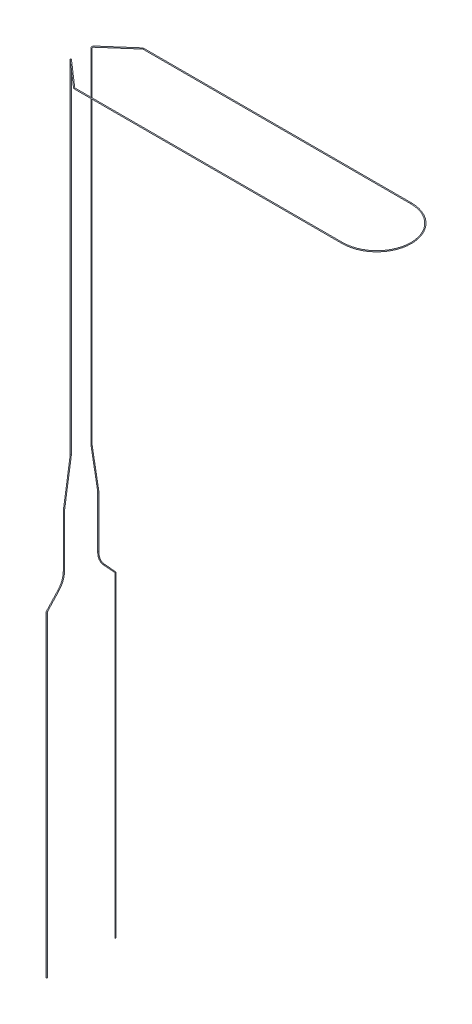
ISO-10303-21;
HEADER;
FILE_DESCRIPTION(('STEP AP214'),'2;1');
FILE_NAME('part.step','',(''),(''),'','','');
FILE_SCHEMA(('AUTOMOTIVE_DESIGN { 1 0 10303 214 1 1 1 1 }'));
ENDSEC;
DATA;
#1=APPLICATION_CONTEXT('core data for automotive mechanical design processes');
#2=APPLICATION_PROTOCOL_DEFINITION('international standard','automotive_design',2000,#1);
#3=PRODUCT_CONTEXT('',#1,'mechanical');
#4=PRODUCT('Part','Part','',(#3));
#5=PRODUCT_RELATED_PRODUCT_CATEGORY('part','',(#4));
#6=PRODUCT_DEFINITION_FORMATION('','',#4);
#7=PRODUCT_DEFINITION_CONTEXT('part definition',#1,'design');
#8=PRODUCT_DEFINITION('design','',#6,#7);
#9=PRODUCT_DEFINITION_SHAPE('','',#8);
#10=(LENGTH_UNIT() NAMED_UNIT(*) SI_UNIT(.MILLI.,.METRE.));
#11=(NAMED_UNIT(*) PLANE_ANGLE_UNIT() SI_UNIT($,.RADIAN.));
#12=(NAMED_UNIT(*) SI_UNIT($,.STERADIAN.) SOLID_ANGLE_UNIT());
#13=UNCERTAINTY_MEASURE_WITH_UNIT(LENGTH_MEASURE(1.E-05),#10,'distance_accuracy_value','');
#14=(GEOMETRIC_REPRESENTATION_CONTEXT(3) GLOBAL_UNCERTAINTY_ASSIGNED_CONTEXT((#13)) GLOBAL_UNIT_ASSIGNED_CONTEXT((#10,
#11,#12)) REPRESENTATION_CONTEXT('',''));
#15=CARTESIAN_POINT('',(0.,0.,0.));
#16=DIRECTION('',(0.,0.,1.));
#17=DIRECTION('',(1.,0.,0.));
#18=AXIS2_PLACEMENT_3D('',#15,#16,#17);
#19=CARTESIAN_POINT('',(0.,-200.,20.));
#20=DIRECTION('',(0.,-1.,0.));
#21=DIRECTION('',(-1.,0.,0.));
#22=AXIS2_PLACEMENT_3D('',#19,#20,#21);
#23=PLANE('',#22);
#24=CARTESIAN_POINT('',(0.,-200.,20.));
#25=DIRECTION('',(0.,-1.,0.));
#26=DIRECTION('',(-1.,0.,0.));
#27=AXIS2_PLACEMENT_3D('',#24,#25,#26);
#28=CIRCLE('',#27,0.25);
#29=CARTESIAN_POINT('',(-0.249999999999906,-200.,20.));
#30=VERTEX_POINT('',#29);
#31=EDGE_CURVE('E142',#30,#30,#28,.T.);
#32=ORIENTED_EDGE('',*,*,#31,.T.);
#33=EDGE_LOOP('',(#32));
#34=FACE_BOUND('',#33,.T.);
#35=ADVANCED_FACE('F48',(#34),#23,.T.);
#36=CARTESIAN_POINT('',(0.,-200.,-20.));
#37=DIRECTION('',(0.,1.,0.));
#38=DIRECTION('',(-1.,0.,0.));
#39=AXIS2_PLACEMENT_3D('',#36,#37,#38);
#40=PLANE('',#39);
#41=CARTESIAN_POINT('',(0.,-200.,-20.));
#42=DIRECTION('',(0.,1.,0.));
#43=DIRECTION('',(-1.,0.,0.));
#44=AXIS2_PLACEMENT_3D('',#41,#42,#43);
#45=CIRCLE('',#44,0.25);
#46=CARTESIAN_POINT('',(-0.249999999999906,-200.,-20.));
#47=VERTEX_POINT('',#46);
#48=EDGE_CURVE('E11',#47,#47,#45,.T.);
#49=ORIENTED_EDGE('',*,*,#48,.F.);
#50=EDGE_LOOP('',(#49));
#51=FACE_BOUND('',#50,.T.);
#52=ADVANCED_FACE('F150',(#51),#40,.F.);
#53=CARTESIAN_POINT('',(0.,-200.,20.));
#54=DIRECTION('',(0.,1.,0.));
#55=DIRECTION('',(-1.,0.,0.));
#56=AXIS2_PLACEMENT_3D('',#53,#54,#55);
#57=CYLINDRICAL_SURFACE('',#56,0.25);
#58=CARTESIAN_POINT('',(0.,-16.2259715403941,20.));
#59=DIRECTION('',(0.,-1.,0.));
#60=DIRECTION('',(-1.,0.,0.));
#61=AXIS2_PLACEMENT_3D('',#58,#59,#60);
#62=CIRCLE('',#61,0.25);
#63=CARTESIAN_POINT('',(0.,-16.2259715403941,20.25));
#64=VERTEX_POINT('',#63);
#65=EDGE_CURVE('E139',#64,#64,#62,.T.);
#66=ORIENTED_EDGE('',*,*,#65,.T.);
#67=EDGE_LOOP('',(#66));
#68=FACE_BOUND('',#67,.T.);
#69=ORIENTED_EDGE('',*,*,#31,.F.);
#70=EDGE_LOOP('',(#69));
#71=FACE_BOUND('',#70,.T.);
#72=ADVANCED_FACE('F147',(#68,#71),#57,.T.);
#73=CARTESIAN_POINT('',(0.,-16.2259715403941,19.));
#74=DIRECTION('',(-1.,0.,0.));
#75=DIRECTION('',(0.,0.,1.));
#76=AXIS2_PLACEMENT_3D('',#73,#74,#75);
#77=TOROIDAL_SURFACE('',#76,1.,0.25);
#78=CARTESIAN_POINT('',(0.,-15.5476836140616,19.7347962227662));
#79=DIRECTION('',(0.,-0.734796222766241,0.678287926332516));
#80=DIRECTION('',(-1.,0.,0.));
#81=AXIS2_PLACEMENT_3D('',#78,#79,#80);
#82=CIRCLE('',#81,0.25);
#83=CARTESIAN_POINT('',(0.,-15.3781116324784,19.9184952784578));
#84=VERTEX_POINT('',#83);
#85=EDGE_CURVE('E136',#84,#84,#82,.T.);
#86=CARTESIAN_POINT('',(0.,-16.2259715403941,19.));
#87=DIRECTION('',(-1.,0.,0.));
#88=DIRECTION('',(0.,0.,1.));
#89=AXIS2_PLACEMENT_3D('',#86,#87,#88);
#90=CIRCLE('',#89,1.25);
#91=EDGE_CURVE('',#64,#84,#90,.T.);
#92=ORIENTED_EDGE('',*,*,#65,.F.);
#93=ORIENTED_EDGE('',*,*,#85,.T.);
#94=ORIENTED_EDGE('',*,*,#91,.T.);
#95=ORIENTED_EDGE('',*,*,#91,.F.);
#96=EDGE_LOOP('',(#92,#94,#93,#95));
#97=FACE_BOUND('',#96,.T.);
#98=ADVANCED_FACE('F149',(#97),#77,.T.);
#99=CARTESIAN_POINT('',(0.,-15.5476836140616,19.7347962227662));
#100=DIRECTION('',(0.,0.734796222766239,-0.678287926332518));
#101=DIRECTION('',(0.,0.678287926332518,0.734796222766239));
#102=AXIS2_PLACEMENT_3D('',#99,#100,#101);
#103=CYLINDRICAL_SURFACE('',#102,0.25);
#104=CARTESIAN_POINT('',(0.,-8.44945511599021,13.1824453268051));
#105=DIRECTION('',(0.,-0.734796222766239,0.678287926332518));
#106=DIRECTION('',(-1.,0.,0.));
#107=AXIS2_PLACEMENT_3D('',#104,#105,#106);
#108=CIRCLE('',#107,0.25);
#109=CARTESIAN_POINT('',(0.,-8.61902709757335,12.9987462711136));
#110=VERTEX_POINT('',#109);
#111=EDGE_CURVE('E133',#110,#110,#108,.T.);
#112=ORIENTED_EDGE('',*,*,#111,.T.);
#113=EDGE_LOOP('',(#112));
#114=FACE_BOUND('',#113,.T.);
#115=ORIENTED_EDGE('',*,*,#85,.F.);
#116=EDGE_LOOP('',(#115));
#117=FACE_BOUND('',#116,.T.);
#118=ADVANCED_FACE('F157',(#114,#117),#103,.T.);
#119=CARTESIAN_POINT('',(0.,-0.309999999999999,22.));
#120=DIRECTION('',(1.,0.,0.));
#121=DIRECTION('',(0.,0.,-1.));
#122=AXIS2_PLACEMENT_3D('',#119,#120,#121);
#123=TOROIDAL_SURFACE('',#122,12.,0.25);
#124=CARTESIAN_POINT('',(0.,-0.310000000000005,10.));
#125=DIRECTION('',(0.,-1.,0.));
#126=DIRECTION('',(-1.,0.,0.));
#127=AXIS2_PLACEMENT_3D('',#124,#125,#126);
#128=CIRCLE('',#127,0.25);
#129=CARTESIAN_POINT('',(0.,-0.310000000000005,9.75));
#130=VERTEX_POINT('',#129);
#131=EDGE_CURVE('E130',#130,#130,#128,.T.);
#132=CARTESIAN_POINT('',(0.,-0.309999999999999,22.));
#133=DIRECTION('',(1.,0.,0.));
#134=DIRECTION('',(0.,0.,-1.));
#135=AXIS2_PLACEMENT_3D('',#132,#133,#134);
#136=CIRCLE('',#135,12.25);
#137=EDGE_CURVE('',#110,#130,#136,.T.);
#138=ORIENTED_EDGE('',*,*,#111,.F.);
#139=ORIENTED_EDGE('',*,*,#131,.T.);
#140=ORIENTED_EDGE('',*,*,#137,.T.);
#141=ORIENTED_EDGE('',*,*,#137,.F.);
#142=EDGE_LOOP('',(#138,#140,#139,#141));
#143=FACE_BOUND('',#142,.T.);
#144=ADVANCED_FACE('F262',(#143),#123,.T.);
#145=CARTESIAN_POINT('',(0.,-0.310000000000005,10.));
#146=DIRECTION('',(0.,1.,0.));
#147=DIRECTION('',(-1.,0.,0.));
#148=AXIS2_PLACEMENT_3D('',#145,#146,#147);
#149=CYLINDRICAL_SURFACE('',#148,0.25);
#150=CARTESIAN_POINT('',(0.,0.,10.));
#151=DIRECTION('',(0.,-1.,0.));
#152=DIRECTION('',(-1.,0.,0.));
#153=AXIS2_PLACEMENT_3D('',#150,#151,#152);
#154=CIRCLE('',#153,0.25);
#155=CARTESIAN_POINT('',(-0.249999999999996,0.,10.));
#156=VERTEX_POINT('',#155);
#157=EDGE_CURVE('E127',#156,#156,#154,.T.);
#158=ORIENTED_EDGE('',*,*,#157,.T.);
#159=EDGE_LOOP('',(#158));
#160=FACE_BOUND('',#159,.T.);
#161=ORIENTED_EDGE('',*,*,#131,.F.);
#162=EDGE_LOOP('',(#161));
#163=FACE_BOUND('',#162,.T.);
#164=ADVANCED_FACE('F258',(#160,#163),#149,.T.);
#165=CARTESIAN_POINT('',(0.,0.,10.));
#166=DIRECTION('',(0.,1.,0.));
#167=DIRECTION('',(-1.,0.,0.));
#168=AXIS2_PLACEMENT_3D('',#165,#166,#167);
#169=CYLINDRICAL_SURFACE('',#168,0.25);
#170=CARTESIAN_POINT('',(0.,29.2352678101705,10.));
#171=DIRECTION('',(0.,-1.,0.));
#172=DIRECTION('',(-1.,0.,0.));
#173=AXIS2_PLACEMENT_3D('',#170,#171,#172);
#174=CIRCLE('',#173,0.25);
#175=CARTESIAN_POINT('',(0.,29.2352678101705,10.25));
#176=VERTEX_POINT('',#175);
#177=EDGE_CURVE('E124',#176,#176,#174,.T.);
#178=ORIENTED_EDGE('',*,*,#177,.T.);
#179=EDGE_LOOP('',(#178));
#180=FACE_BOUND('',#179,.T.);
#181=ORIENTED_EDGE('',*,*,#157,.F.);
#182=EDGE_LOOP('',(#181));
#183=FACE_BOUND('',#182,.T.);
#184=ADVANCED_FACE('F254',(#180,#183),#169,.T.);
#185=CARTESIAN_POINT('',(0.,29.2352678101705,0.));
#186=DIRECTION('',(-1.,0.,0.));
#187=DIRECTION('',(0.,0.,1.));
#188=AXIS2_PLACEMENT_3D('',#185,#186,#187);
#189=TOROIDAL_SURFACE('',#188,10.,0.25);
#190=CARTESIAN_POINT('',(0.,30.7558396527099,9.88371697650618));
#191=DIRECTION('',(0.,-0.988371697650617,0.152057184253941));
#192=DIRECTION('',(-1.,0.,0.));
#193=AXIS2_PLACEMENT_3D('',#190,#191,#192);
#194=CIRCLE('',#193,0.25);
#195=CARTESIAN_POINT('',(0.,30.7938539487734,10.1308099009188));
#196=VERTEX_POINT('',#195);
#197=EDGE_CURVE('E121',#196,#196,#194,.T.);
#198=CARTESIAN_POINT('',(0.,29.2352678101705,0.));
#199=DIRECTION('',(-1.,0.,0.));
#200=DIRECTION('',(0.,0.,1.));
#201=AXIS2_PLACEMENT_3D('',#198,#199,#200);
#202=CIRCLE('',#201,10.25);
#203=EDGE_CURVE('',#176,#196,#202,.T.);
#204=ORIENTED_EDGE('',*,*,#177,.F.);
#205=ORIENTED_EDGE('',*,*,#197,.T.);
#206=ORIENTED_EDGE('',*,*,#203,.T.);
#207=ORIENTED_EDGE('',*,*,#203,.F.);
#208=EDGE_LOOP('',(#204,#206,#205,#207));
#209=FACE_BOUND('',#208,.T.);
#210=ADVANCED_FACE('F250',(#209),#189,.T.);
#211=CARTESIAN_POINT('',(0.,30.7558396527099,9.88371697650617));
#212=DIRECTION('',(0.,0.988371697650617,-0.152057184253941));
#213=DIRECTION('',(0.,0.152057184253941,0.988371697650617));
#214=AXIS2_PLACEMENT_3D('',#211,#212,#213);
#215=CYLINDRICAL_SURFACE('',#214,0.25);
#216=CARTESIAN_POINT('',(0.,55.2441603472901,6.11628302349383));
#217=DIRECTION('',(0.,-0.988371697650617,0.152057184253941));
#218=DIRECTION('',(-1.,0.,0.));
#219=AXIS2_PLACEMENT_3D('',#216,#217,#218);
#220=CIRCLE('',#219,0.25);
#221=CARTESIAN_POINT('',(0.,55.2061460512266,5.86919009908118));
#222=VERTEX_POINT('',#221);
#223=EDGE_CURVE('E118',#222,#222,#220,.T.);
#224=ORIENTED_EDGE('',*,*,#223,.T.);
#225=EDGE_LOOP('',(#224));
#226=FACE_BOUND('',#225,.T.);
#227=ORIENTED_EDGE('',*,*,#197,.F.);
#228=EDGE_LOOP('',(#227));
#229=FACE_BOUND('',#228,.T.);
#230=ADVANCED_FACE('F246',(#226,#229),#215,.T.);
#231=CARTESIAN_POINT('',(0.,56.7647321898295,16.));
#232=DIRECTION('',(1.,0.,0.));
#233=DIRECTION('',(0.,0.,-1.));
#234=AXIS2_PLACEMENT_3D('',#231,#232,#233);
#235=TOROIDAL_SURFACE('',#234,10.,0.25);
#236=CARTESIAN_POINT('',(0.,56.7647321898295,6.));
#237=DIRECTION('',(0.,-1.,0.));
#238=DIRECTION('',(-1.,0.,0.));
#239=AXIS2_PLACEMENT_3D('',#236,#237,#238);
#240=CIRCLE('',#239,0.25);
#241=CARTESIAN_POINT('',(0.,56.7647321898295,5.75));
#242=VERTEX_POINT('',#241);
#243=EDGE_CURVE('E115',#242,#242,#240,.T.);
#244=CARTESIAN_POINT('',(0.,56.7647321898295,16.));
#245=DIRECTION('',(1.,0.,0.));
#246=DIRECTION('',(0.,0.,-1.));
#247=AXIS2_PLACEMENT_3D('',#244,#245,#246);
#248=CIRCLE('',#247,10.25);
#249=EDGE_CURVE('',#222,#242,#248,.T.);
#250=ORIENTED_EDGE('',*,*,#223,.F.);
#251=ORIENTED_EDGE('',*,*,#243,.T.);
#252=ORIENTED_EDGE('',*,*,#249,.T.);
#253=ORIENTED_EDGE('',*,*,#249,.F.);
#254=EDGE_LOOP('',(#250,#252,#251,#253));
#255=FACE_BOUND('',#254,.T.);
#256=ADVANCED_FACE('F242',(#255),#235,.T.);
#257=CARTESIAN_POINT('',(0.,56.7647321898296,6.));
#258=DIRECTION('',(0.,1.,0.));
#259=DIRECTION('',(-1.,0.,0.));
#260=AXIS2_PLACEMENT_3D('',#257,#258,#259);
#261=CYLINDRICAL_SURFACE('',#260,0.25);
#262=CARTESIAN_POINT('',(0.,255.,6.));
#263=DIRECTION('',(0.,-1.,0.));
#264=DIRECTION('',(-1.,0.,0.));
#265=AXIS2_PLACEMENT_3D('',#262,#263,#264);
#266=CIRCLE('',#265,0.25);
#267=CARTESIAN_POINT('',(-0.18814417367673,255.,5.83537384803288));
#268=VERTEX_POINT('',#267);
#269=EDGE_CURVE('E112',#268,#268,#266,.T.);
#270=ORIENTED_EDGE('',*,*,#269,.T.);
#271=EDGE_LOOP('',(#270));
#272=FACE_BOUND('',#271,.T.);
#273=ORIENTED_EDGE('',*,*,#243,.F.);
#274=EDGE_LOOP('',(#273));
#275=FACE_BOUND('',#274,.T.);
#276=ADVANCED_FACE('F238',(#272,#275),#261,.T.);
#277=CARTESIAN_POINT('',(0.752576694706885,255.,6.6585046078685));
#278=DIRECTION('',(0.658504607868518,0.,-0.752576694706878));
#279=DIRECTION('',(-0.752576694706878,0.,-0.658504607868518));
#280=AXIS2_PLACEMENT_3D('',#277,#278,#279);
#281=TOROIDAL_SURFACE('',#280,1.,0.25);
#282=CARTESIAN_POINT('',(0.752576694706852,256.,6.65850460786852));
#283=DIRECTION('',(-0.752576694706878,0.,-0.658504607868518));
#284=DIRECTION('',(-0.433628318584071,0.752576694706878,0.495575221238938));
#285=AXIS2_PLACEMENT_3D('',#282,#283,#284);
#286=CIRCLE('',#285,0.25);
#287=CARTESIAN_POINT('',(0.752576694706844,256.25,6.65850460786852));
#288=VERTEX_POINT('',#287);
#289=EDGE_CURVE('E109',#288,#288,#286,.T.);
#290=CARTESIAN_POINT('',(0.752576694706885,255.,6.6585046078685));
#291=DIRECTION('',(0.658504607868518,0.,-0.752576694706878));
#292=DIRECTION('',(-0.752576694706878,0.,-0.658504607868518));
#293=AXIS2_PLACEMENT_3D('',#290,#291,#292);
#294=CIRCLE('',#293,1.25);
#295=EDGE_CURVE('',#268,#288,#294,.T.);
#296=ORIENTED_EDGE('',*,*,#269,.F.);
#297=ORIENTED_EDGE('',*,*,#289,.T.);
#298=ORIENTED_EDGE('',*,*,#295,.T.);
#299=ORIENTED_EDGE('',*,*,#295,.F.);
#300=EDGE_LOOP('',(#296,#298,#297,#299));
#301=FACE_BOUND('',#300,.T.);
#302=ADVANCED_FACE('F234',(#301),#281,.T.);
#303=CARTESIAN_POINT('',(0.752576694706852,256.,6.65850460786849));
#304=DIRECTION('',(0.752576694706878,0.,0.658504607868518));
#305=DIRECTION('',(0.658504607868518,0.,-0.752576694706878));
#306=AXIS2_PLACEMENT_3D('',#303,#304,#305);
#307=CYLINDRICAL_SURFACE('',#306,0.25);
#308=CARTESIAN_POINT('',(15.7172305082364,256.,19.7525766947068));
#309=DIRECTION('',(-0.752576694706878,0.,-0.658504607868518));
#310=DIRECTION('',(-0.433628318584071,0.752576694706878,0.495575221238938));
#311=AXIS2_PLACEMENT_3D('',#308,#309,#310);
#312=CIRCLE('',#311,0.25);
#313=CARTESIAN_POINT('',(15.5526043562693,256.,19.9407208683836));
#314=VERTEX_POINT('',#313);
#315=EDGE_CURVE('E106',#314,#314,#312,.T.);
#316=ORIENTED_EDGE('',*,*,#315,.T.);
#317=EDGE_LOOP('',(#316));
#318=FACE_BOUND('',#317,.T.);
#319=ORIENTED_EDGE('',*,*,#289,.F.);
#320=EDGE_LOOP('',(#319));
#321=FACE_BOUND('',#320,.T.);
#322=ADVANCED_FACE('F230',(#318,#321),#307,.T.);
#323=CARTESIAN_POINT('',(16.375735116105,256.,19.));
#324=DIRECTION('',(0.,1.,0.));
#325=DIRECTION('',(0.,0.,1.));
#326=AXIS2_PLACEMENT_3D('',#323,#324,#325);
#327=TOROIDAL_SURFACE('',#326,0.999999999999993,0.25);
#328=CARTESIAN_POINT('',(16.375735116105,256.,20.));
#329=DIRECTION('',(-1.,0.,0.));
#330=DIRECTION('',(0.,0.752576694706878,0.658504607868518));
#331=AXIS2_PLACEMENT_3D('',#328,#329,#330);
#332=CIRCLE('',#331,0.25);
#333=CARTESIAN_POINT('',(16.375735116105,256.,20.25));
#334=VERTEX_POINT('',#333);
#335=EDGE_CURVE('E103',#334,#334,#332,.T.);
#336=CARTESIAN_POINT('',(16.375735116105,256.,19.));
#337=DIRECTION('',(0.,1.,0.));
#338=DIRECTION('',(0.,0.,1.));
#339=AXIS2_PLACEMENT_3D('',#336,#337,#338);
#340=CIRCLE('',#339,1.24999999999999);
#341=EDGE_CURVE('',#314,#334,#340,.T.);
#342=ORIENTED_EDGE('',*,*,#315,.F.);
#343=ORIENTED_EDGE('',*,*,#335,.T.);
#344=ORIENTED_EDGE('',*,*,#341,.T.);
#345=ORIENTED_EDGE('',*,*,#341,.F.);
#346=EDGE_LOOP('',(#342,#344,#343,#345));
#347=FACE_BOUND('',#346,.T.);
#348=ADVANCED_FACE('F226',(#347),#327,.T.);
#349=CARTESIAN_POINT('',(16.375735116105,256.,20.));
#350=DIRECTION('',(1.,0.,0.));
#351=DIRECTION('',(0.,0.,-1.));
#352=AXIS2_PLACEMENT_3D('',#349,#350,#351);
#353=CYLINDRICAL_SURFACE('',#352,0.25);
#354=CARTESIAN_POINT('',(172.,256.,20.));
#355=DIRECTION('',(-1.,0.,0.));
#356=DIRECTION('',(0.,0.752576694706878,0.658504607868518));
#357=AXIS2_PLACEMENT_3D('',#354,#355,#356);
#358=CIRCLE('',#357,0.25);
#359=CARTESIAN_POINT('',(172.,256.,20.25));
#360=VERTEX_POINT('',#359);
#361=EDGE_CURVE('E100',#360,#360,#358,.T.);
#362=ORIENTED_EDGE('',*,*,#361,.T.);
#363=EDGE_LOOP('',(#362));
#364=FACE_BOUND('',#363,.T.);
#365=ORIENTED_EDGE('',*,*,#335,.F.);
#366=EDGE_LOOP('',(#365));
#367=FACE_BOUND('',#366,.T.);
#368=ADVANCED_FACE('F222',(#364,#367),#353,.T.);
#369=CARTESIAN_POINT('',(172.,256.,0.));
#370=DIRECTION('',(0.,1.,0.));
#371=DIRECTION('',(0.,0.,1.));
#372=AXIS2_PLACEMENT_3D('',#369,#370,#371);
#373=TOROIDAL_SURFACE('',#372,20.,0.25);
#374=CARTESIAN_POINT('',(172.,256.,-20.));
#375=DIRECTION('',(1.,0.,0.));
#376=DIRECTION('',(0.,0.752576694706878,-0.658504607868518));
#377=AXIS2_PLACEMENT_3D('',#374,#375,#376);
#378=CIRCLE('',#377,0.25);
#379=CARTESIAN_POINT('',(172.,256.,-20.25));
#380=VERTEX_POINT('',#379);
#381=EDGE_CURVE('E97',#380,#380,#378,.T.);
#382=CARTESIAN_POINT('',(172.,256.,0.));
#383=DIRECTION('',(0.,1.,0.));
#384=DIRECTION('',(0.,0.,1.));
#385=AXIS2_PLACEMENT_3D('',#382,#383,#384);
#386=CIRCLE('',#385,20.25);
#387=EDGE_CURVE('',#360,#380,#386,.T.);
#388=ORIENTED_EDGE('',*,*,#361,.F.);
#389=ORIENTED_EDGE('',*,*,#381,.T.);
#390=ORIENTED_EDGE('',*,*,#387,.T.);
#391=ORIENTED_EDGE('',*,*,#387,.F.);
#392=EDGE_LOOP('',(#388,#390,#389,#391));
#393=FACE_BOUND('',#392,.T.);
#394=ADVANCED_FACE('F218',(#393),#373,.T.);
#395=CARTESIAN_POINT('',(172.,256.,-20.));
#396=DIRECTION('',(-1.,0.,0.));
#397=DIRECTION('',(0.,0.,1.));
#398=AXIS2_PLACEMENT_3D('',#395,#396,#397);
#399=CYLINDRICAL_SURFACE('',#398,0.25);
#400=CARTESIAN_POINT('',(16.375735116105,256.,-20.));
#401=DIRECTION('',(1.,0.,0.));
#402=DIRECTION('',(0.,0.752576694706878,-0.658504607868518));
#403=AXIS2_PLACEMENT_3D('',#400,#401,#402);
#404=CIRCLE('',#403,0.25);
#405=CARTESIAN_POINT('',(16.375735116105,256.,-20.25));
#406=VERTEX_POINT('',#405);
#407=EDGE_CURVE('E94',#406,#406,#404,.T.);
#408=ORIENTED_EDGE('',*,*,#407,.T.);
#409=EDGE_LOOP('',(#408));
#410=FACE_BOUND('',#409,.T.);
#411=ORIENTED_EDGE('',*,*,#381,.F.);
#412=EDGE_LOOP('',(#411));
#413=FACE_BOUND('',#412,.T.);
#414=ADVANCED_FACE('F214',(#410,#413),#399,.T.);
#415=CARTESIAN_POINT('',(16.375735116105,256.,-19.));
#416=DIRECTION('',(0.,1.,0.));
#417=DIRECTION('',(0.,0.,1.));
#418=AXIS2_PLACEMENT_3D('',#415,#416,#417);
#419=TOROIDAL_SURFACE('',#418,0.999999999999997,0.25);
#420=CARTESIAN_POINT('',(15.7172305082365,256.,-19.7525766947069));
#421=DIRECTION('',(0.752576694706876,0.,-0.65850460786852));
#422=DIRECTION('',(-0.433628318584072,0.752576694706878,-0.495575221238937));
#423=AXIS2_PLACEMENT_3D('',#420,#421,#422);
#424=CIRCLE('',#423,0.25);
#425=CARTESIAN_POINT('',(15.5526043562693,256.,-19.9407208683836));
#426=VERTEX_POINT('',#425);
#427=EDGE_CURVE('E91',#426,#426,#424,.T.);
#428=CARTESIAN_POINT('',(16.375735116105,256.,-19.));
#429=DIRECTION('',(0.,1.,0.));
#430=DIRECTION('',(0.,0.,1.));
#431=AXIS2_PLACEMENT_3D('',#428,#429,#430);
#432=CIRCLE('',#431,1.25);
#433=EDGE_CURVE('',#406,#426,#432,.T.);
#434=ORIENTED_EDGE('',*,*,#407,.F.);
#435=ORIENTED_EDGE('',*,*,#427,.T.);
#436=ORIENTED_EDGE('',*,*,#433,.T.);
#437=ORIENTED_EDGE('',*,*,#433,.F.);
#438=EDGE_LOOP('',(#434,#436,#435,#437));
#439=FACE_BOUND('',#438,.T.);
#440=ADVANCED_FACE('F210',(#439),#419,.T.);
#441=CARTESIAN_POINT('',(15.7172305082364,256.,-19.7525766947069));
#442=DIRECTION('',(-0.752576694706878,0.,0.658504607868518));
#443=DIRECTION('',(0.658504607868518,0.,0.752576694706878));
#444=AXIS2_PLACEMENT_3D('',#441,#442,#443);
#445=CYLINDRICAL_SURFACE('',#444,0.25);
#446=CARTESIAN_POINT('',(0.752576694706852,256.,-6.65850460786852));
#447=DIRECTION('',(0.752576694706878,0.,-0.658504607868518));
#448=DIRECTION('',(-0.433628318584071,0.752576694706878,-0.495575221238938));
#449=AXIS2_PLACEMENT_3D('',#446,#447,#448);
#450=CIRCLE('',#449,0.25);
#451=CARTESIAN_POINT('',(0.752576694706846,256.25,-6.65850460786852));
#452=VERTEX_POINT('',#451);
#453=EDGE_CURVE('E88',#452,#452,#450,.T.);
#454=ORIENTED_EDGE('',*,*,#453,.T.);
#455=EDGE_LOOP('',(#454));
#456=FACE_BOUND('',#455,.T.);
#457=ORIENTED_EDGE('',*,*,#427,.F.);
#458=EDGE_LOOP('',(#457));
#459=FACE_BOUND('',#458,.T.);
#460=ADVANCED_FACE('F206',(#456,#459),#445,.T.);
#461=CARTESIAN_POINT('',(0.752576694706878,255.,-6.65850460786851));
#462=DIRECTION('',(0.658504607868518,0.,0.752576694706878));
#463=DIRECTION('',(0.752576694706878,0.,-0.658504607868518));
#464=AXIS2_PLACEMENT_3D('',#461,#462,#463);
#465=TOROIDAL_SURFACE('',#464,1.,0.25);
#466=CARTESIAN_POINT('',(1.03862880298789E-13,255.,-5.99999999999999));
#467=DIRECTION('',(0.,1.,0.));
#468=DIRECTION('',(-1.,0.,0.));
#469=AXIS2_PLACEMENT_3D('',#466,#467,#468);
#470=CIRCLE('',#469,0.25);
#471=CARTESIAN_POINT('',(-0.188144173676659,255.,-5.83537384803279));
#472=VERTEX_POINT('',#471);
#473=EDGE_CURVE('E85',#472,#472,#470,.T.);
#474=CARTESIAN_POINT('',(0.752576694706878,255.,-6.65850460786851));
#475=DIRECTION('',(0.658504607868518,0.,0.752576694706878));
#476=DIRECTION('',(0.752576694706878,0.,-0.658504607868518));
#477=AXIS2_PLACEMENT_3D('',#474,#475,#476);
#478=CIRCLE('',#477,1.25);
#479=EDGE_CURVE('',#452,#472,#478,.T.);
#480=ORIENTED_EDGE('',*,*,#453,.F.);
#481=ORIENTED_EDGE('',*,*,#473,.T.);
#482=ORIENTED_EDGE('',*,*,#479,.T.);
#483=ORIENTED_EDGE('',*,*,#479,.F.);
#484=EDGE_LOOP('',(#480,#482,#481,#483));
#485=FACE_BOUND('',#484,.T.);
#486=ADVANCED_FACE('F202',(#485),#465,.T.);
#487=CARTESIAN_POINT('',(0.,255.,-6.));
#488=DIRECTION('',(0.,-1.,0.));
#489=DIRECTION('',(1.,0.,0.));
#490=AXIS2_PLACEMENT_3D('',#487,#488,#489);
#491=CYLINDRICAL_SURFACE('',#490,0.25);
#492=CARTESIAN_POINT('',(0.,56.7647321898296,-6.));
#493=DIRECTION('',(0.,1.,0.));
#494=DIRECTION('',(-1.,0.,0.));
#495=AXIS2_PLACEMENT_3D('',#492,#493,#494);
#496=CIRCLE('',#495,0.25);
#497=CARTESIAN_POINT('',(0.,56.7647321898296,-5.75000000000042));
#498=VERTEX_POINT('',#497);
#499=EDGE_CURVE('E82',#498,#498,#496,.T.);
#500=ORIENTED_EDGE('',*,*,#499,.T.);
#501=EDGE_LOOP('',(#500));
#502=FACE_BOUND('',#501,.T.);
#503=ORIENTED_EDGE('',*,*,#473,.F.);
#504=EDGE_LOOP('',(#503));
#505=FACE_BOUND('',#504,.T.);
#506=ADVANCED_FACE('F198',(#502,#505),#491,.T.);
#507=CARTESIAN_POINT('',(1.02533619930362E-13,56.7647321898295,-16.));
#508=DIRECTION('',(1.,0.,0.));
#509=DIRECTION('',(0.,0.,-1.));
#510=AXIS2_PLACEMENT_3D('',#507,#508,#509);
#511=TOROIDAL_SURFACE('',#510,9.99999999999958,0.25);
#512=CARTESIAN_POINT('',(0.,55.2441603472901,-6.11628302349383));
#513=DIRECTION('',(0.,0.988371697650617,0.152057184253942));
#514=DIRECTION('',(-1.,0.,0.));
#515=AXIS2_PLACEMENT_3D('',#512,#513,#514);
#516=CIRCLE('',#515,0.25);
#517=CARTESIAN_POINT('',(0.,55.2061460512267,-5.86919009908159));
#518=VERTEX_POINT('',#517);
#519=EDGE_CURVE('E79',#518,#518,#516,.T.);
#520=CARTESIAN_POINT('',(1.02533619930362E-13,56.7647321898295,-16.));
#521=DIRECTION('',(1.,0.,0.));
#522=DIRECTION('',(0.,0.,-1.));
#523=AXIS2_PLACEMENT_3D('',#520,#521,#522);
#524=CIRCLE('',#523,10.2499999999996);
#525=EDGE_CURVE('',#498,#518,#524,.T.);
#526=ORIENTED_EDGE('',*,*,#499,.F.);
#527=ORIENTED_EDGE('',*,*,#519,.T.);
#528=ORIENTED_EDGE('',*,*,#525,.T.);
#529=ORIENTED_EDGE('',*,*,#525,.F.);
#530=EDGE_LOOP('',(#526,#528,#527,#529));
#531=FACE_BOUND('',#530,.T.);
#532=ADVANCED_FACE('F194',(#531),#511,.T.);
#533=CARTESIAN_POINT('',(0.,55.2441603472901,-6.11628302349383));
#534=DIRECTION('',(0.,-0.988371697650617,-0.152057184253941));
#535=DIRECTION('',(0.,0.152057184253941,-0.988371697650617));
#536=AXIS2_PLACEMENT_3D('',#533,#534,#535);
#537=CYLINDRICAL_SURFACE('',#536,0.25);
#538=CARTESIAN_POINT('',(0.,30.7558396527099,-9.88371697650617));
#539=DIRECTION('',(0.,0.988371697650617,0.152057184253941));
#540=DIRECTION('',(-1.,0.,0.));
#541=AXIS2_PLACEMENT_3D('',#538,#539,#540);
#542=CIRCLE('',#541,0.25);
#543=CARTESIAN_POINT('',(0.,30.7938539487734,-10.1308099009188));
#544=VERTEX_POINT('',#543);
#545=EDGE_CURVE('E76',#544,#544,#542,.T.);
#546=ORIENTED_EDGE('',*,*,#545,.T.);
#547=EDGE_LOOP('',(#546));
#548=FACE_BOUND('',#547,.T.);
#549=ORIENTED_EDGE('',*,*,#519,.F.);
#550=EDGE_LOOP('',(#549));
#551=FACE_BOUND('',#550,.T.);
#552=ADVANCED_FACE('F190',(#548,#551),#537,.T.);
#553=CARTESIAN_POINT('',(0.,29.2352678101705,0.));
#554=DIRECTION('',(-1.,0.,0.));
#555=DIRECTION('',(0.,0.,1.));
#556=AXIS2_PLACEMENT_3D('',#553,#554,#555);
#557=TOROIDAL_SURFACE('',#556,10.,0.25);
#558=CARTESIAN_POINT('',(1.02192484306796E-13,29.2352678101705,-10.));
#559=DIRECTION('',(0.,1.,0.));
#560=DIRECTION('',(-1.,0.,0.));
#561=AXIS2_PLACEMENT_3D('',#558,#559,#560);
#562=CIRCLE('',#561,0.25);
#563=CARTESIAN_POINT('',(1.04606801929071E-13,29.2352678101705,-10.25));
#564=VERTEX_POINT('',#563);
#565=EDGE_CURVE('E73',#564,#564,#562,.T.);
#566=CARTESIAN_POINT('',(0.,29.2352678101705,0.));
#567=DIRECTION('',(-1.,0.,0.));
#568=DIRECTION('',(0.,0.,1.));
#569=AXIS2_PLACEMENT_3D('',#566,#567,#568);
#570=CIRCLE('',#569,10.25);
#571=EDGE_CURVE('',#544,#564,#570,.T.);
#572=ORIENTED_EDGE('',*,*,#545,.F.);
#573=ORIENTED_EDGE('',*,*,#565,.T.);
#574=ORIENTED_EDGE('',*,*,#571,.T.);
#575=ORIENTED_EDGE('',*,*,#571,.F.);
#576=EDGE_LOOP('',(#572,#574,#573,#575));
#577=FACE_BOUND('',#576,.T.);
#578=ADVANCED_FACE('F186',(#577),#557,.T.);
#579=CARTESIAN_POINT('',(1.08366228480326E-13,29.2352678101705,-10.));
#580=DIRECTION('',(0.,-1.,0.));
#581=DIRECTION('',(1.,0.,0.));
#582=AXIS2_PLACEMENT_3D('',#579,#580,#581);
#583=CYLINDRICAL_SURFACE('',#582,0.25);
#584=CARTESIAN_POINT('',(1.07351350778106E-13,0.,-10.));
#585=DIRECTION('',(0.,1.,0.));
#586=DIRECTION('',(-1.,0.,0.));
#587=AXIS2_PLACEMENT_3D('',#584,#585,#586);
#588=CIRCLE('',#587,0.25);
#589=CARTESIAN_POINT('',(-0.249999999999893,0.,-10.));
#590=VERTEX_POINT('',#589);
#591=EDGE_CURVE('E70',#590,#590,#588,.T.);
#592=ORIENTED_EDGE('',*,*,#591,.T.);
#593=EDGE_LOOP('',(#592));
#594=FACE_BOUND('',#593,.T.);
#595=ORIENTED_EDGE('',*,*,#565,.F.);
#596=EDGE_LOOP('',(#595));
#597=FACE_BOUND('',#596,.T.);
#598=ADVANCED_FACE('F182',(#594,#597),#583,.T.);
#599=CARTESIAN_POINT('',(-2.07671401586575E-12,0.,-10.));
#600=DIRECTION('',(0.,-1.,0.));
#601=DIRECTION('',(1.,0.,0.));
#602=AXIS2_PLACEMENT_3D('',#599,#600,#601);
#603=CYLINDRICAL_SURFACE('',#602,0.25);
#604=CARTESIAN_POINT('',(-2.0733394759364E-12,-0.310000000000005,-10.));
#605=DIRECTION('',(0.,1.,0.));
#606=DIRECTION('',(-1.,0.,0.));
#607=AXIS2_PLACEMENT_3D('',#604,#605,#606);
#608=CIRCLE('',#607,0.25);
#609=CARTESIAN_POINT('',(-2.11875201404551E-12,-0.310000000000005,-9.75));
#610=VERTEX_POINT('',#609);
#611=EDGE_CURVE('E67',#610,#610,#608,.T.);
#612=ORIENTED_EDGE('',*,*,#611,.T.);
#613=EDGE_LOOP('',(#612));
#614=FACE_BOUND('',#613,.T.);
#615=ORIENTED_EDGE('',*,*,#591,.F.);
#616=EDGE_LOOP('',(#615));
#617=FACE_BOUND('',#616,.T.);
#618=ADVANCED_FACE('F178',(#614,#617),#603,.T.);
#619=CARTESIAN_POINT('',(1.06462353301213E-13,-0.31,-22.));
#620=DIRECTION('',(1.,0.,0.));
#621=DIRECTION('',(0.,0.,-1.));
#622=AXIS2_PLACEMENT_3D('',#619,#620,#621);
#623=TOROIDAL_SURFACE('',#622,12.,0.25);
#624=CARTESIAN_POINT('',(0.,-8.44945511599021,-13.1824453268051));
#625=DIRECTION('',(0.,0.734796222766239,0.678287926332518));
#626=DIRECTION('',(-1.,0.,0.));
#627=AXIS2_PLACEMENT_3D('',#624,#625,#626);
#628=CIRCLE('',#627,0.25);
#629=CARTESIAN_POINT('',(0.,-8.61902709757334,-12.9987462711136));
#630=VERTEX_POINT('',#629);
#631=EDGE_CURVE('E62',#630,#630,#628,.T.);
#632=CARTESIAN_POINT('',(1.06462353301213E-13,-0.31,-22.));
#633=DIRECTION('',(1.,0.,0.));
#634=DIRECTION('',(0.,0.,-1.));
#635=AXIS2_PLACEMENT_3D('',#632,#633,#634);
#636=CIRCLE('',#635,12.25);
#637=EDGE_CURVE('',#610,#630,#636,.T.);
#638=ORIENTED_EDGE('',*,*,#611,.F.);
#639=ORIENTED_EDGE('',*,*,#631,.T.);
#640=ORIENTED_EDGE('',*,*,#637,.T.);
#641=ORIENTED_EDGE('',*,*,#637,.F.);
#642=EDGE_LOOP('',(#638,#640,#639,#641));
#643=FACE_BOUND('',#642,.T.);
#644=ADVANCED_FACE('F174',(#643),#623,.T.);
#645=CARTESIAN_POINT('',(0.,-8.44945511599021,-13.1824453268051));
#646=DIRECTION('',(0.,-0.734796222766239,-0.678287926332518));
#647=DIRECTION('',(0.,0.678287926332518,-0.734796222766239));
#648=AXIS2_PLACEMENT_3D('',#645,#646,#647);
#649=CYLINDRICAL_SURFACE('',#648,0.25);
#650=CARTESIAN_POINT('',(0.,-15.5476836140616,-19.7347962227662));
#651=DIRECTION('',(0.,0.734796222766239,0.678287926332518));
#652=DIRECTION('',(-1.,0.,0.));
#653=AXIS2_PLACEMENT_3D('',#650,#651,#652);
#654=CIRCLE('',#653,0.25);
#655=CARTESIAN_POINT('',(0.,-15.3781116324785,-19.9184952784578));
#656=VERTEX_POINT('',#655);
#657=EDGE_CURVE('E58',#656,#656,#654,.T.);
#658=ORIENTED_EDGE('',*,*,#657,.T.);
#659=EDGE_LOOP('',(#658));
#660=FACE_BOUND('',#659,.T.);
#661=ORIENTED_EDGE('',*,*,#631,.F.);
#662=EDGE_LOOP('',(#661));
#663=FACE_BOUND('',#662,.T.);
#664=ADVANCED_FACE('F168',(#660,#663),#649,.T.);
#665=CARTESIAN_POINT('',(0.,-16.2259715403941,-19.));
#666=DIRECTION('',(-1.,0.,0.));
#667=DIRECTION('',(0.,0.,1.));
#668=AXIS2_PLACEMENT_3D('',#665,#666,#667);
#669=TOROIDAL_SURFACE('',#668,1.,0.25);
#670=CARTESIAN_POINT('',(1.00485765984754E-13,-16.2259715403941,-20.));
#671=DIRECTION('',(0.,1.,0.));
#672=DIRECTION('',(-1.,0.,0.));
#673=AXIS2_PLACEMENT_3D('',#670,#671,#672);
#674=CIRCLE('',#673,0.25);
#675=CARTESIAN_POINT('',(1.24628942207504E-13,-16.2259715403941,-20.25));
#676=VERTEX_POINT('',#675);
#677=EDGE_CURVE('E54',#676,#676,#674,.T.);
#678=CARTESIAN_POINT('',(0.,-16.2259715403941,-19.));
#679=DIRECTION('',(-1.,0.,0.));
#680=DIRECTION('',(0.,0.,1.));
#681=AXIS2_PLACEMENT_3D('',#678,#679,#680);
#682=CIRCLE('',#681,1.25);
#683=EDGE_CURVE('',#656,#676,#682,.T.);
#684=ORIENTED_EDGE('',*,*,#657,.F.);
#685=ORIENTED_EDGE('',*,*,#677,.T.);
#686=ORIENTED_EDGE('',*,*,#683,.T.);
#687=ORIENTED_EDGE('',*,*,#683,.F.);
#688=EDGE_LOOP('',(#684,#686,#685,#687));
#689=FACE_BOUND('',#688,.T.);
#690=ADVANCED_FACE('F163',(#689),#669,.T.);
#691=CARTESIAN_POINT('',(0.,-16.2259715403941,-20.));
#692=DIRECTION('',(0.,-1.,0.));
#693=DIRECTION('',(1.,0.,0.));
#694=AXIS2_PLACEMENT_3D('',#691,#692,#693);
#695=CYLINDRICAL_SURFACE('',#694,0.25);
#696=ORIENTED_EDGE('',*,*,#48,.T.);
#697=EDGE_LOOP('',(#696));
#698=FACE_BOUND('',#697,.T.);
#699=ORIENTED_EDGE('',*,*,#677,.F.);
#700=EDGE_LOOP('',(#699));
#701=FACE_BOUND('',#700,.T.);
#702=ADVANCED_FACE('F161',(#698,#701),#695,.T.);
#703=CLOSED_SHELL('',(#35,#52,#72,#98,#118,#144,#164,#184,#210,#230,#256,#276,#302,#322,#348,
#368,#394,#414,#440,#460,#486,#506,#532,#552,#578,#598,#618,#644,#664,#690,#702));
#704=MANIFOLD_SOLID_BREP('B2',#703);
#705=ADVANCED_BREP_SHAPE_REPRESENTATION('',(#18,#704),#14);
#706=SHAPE_DEFINITION_REPRESENTATION(#9,#705);
ENDSEC;
END-ISO-10303-21;
